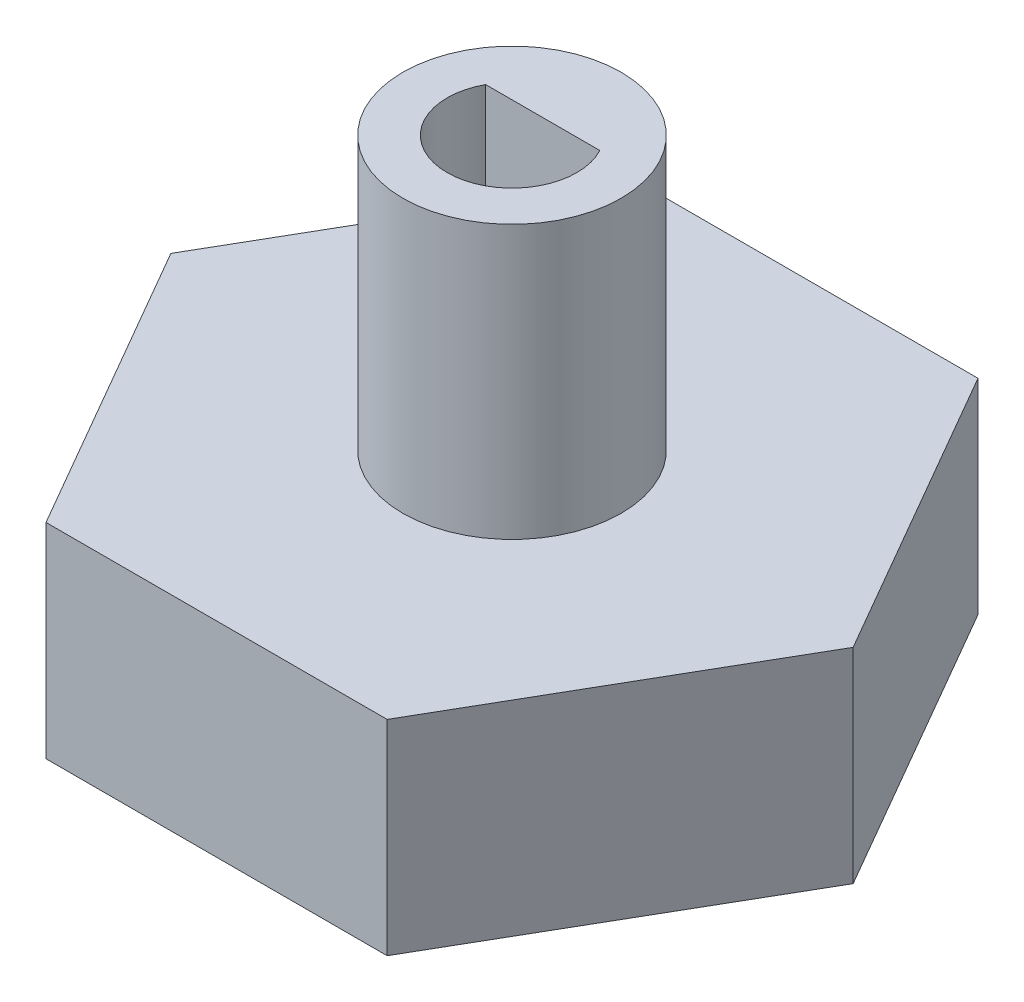
ISO-10303-21;
HEADER;
FILE_DESCRIPTION(('STEP AP214'),'2;1');
FILE_NAME('part.step','',(''),(''),'','','');
FILE_SCHEMA(('AUTOMOTIVE_DESIGN { 1 0 10303 214 1 1 1 1 }'));
ENDSEC;
DATA;
#1=APPLICATION_CONTEXT('core data for automotive mechanical design processes');
#2=APPLICATION_PROTOCOL_DEFINITION('international standard','automotive_design',2000,#1);
#3=PRODUCT_CONTEXT('',#1,'mechanical');
#4=PRODUCT('Part','Part','',(#3));
#5=PRODUCT_RELATED_PRODUCT_CATEGORY('part','',(#4));
#6=PRODUCT_DEFINITION_FORMATION('','',#4);
#7=PRODUCT_DEFINITION_CONTEXT('part definition',#1,'design');
#8=PRODUCT_DEFINITION('design','',#6,#7);
#9=PRODUCT_DEFINITION_SHAPE('','',#8);
#10=(LENGTH_UNIT() NAMED_UNIT(*) SI_UNIT(.MILLI.,.METRE.));
#11=(NAMED_UNIT(*) PLANE_ANGLE_UNIT() SI_UNIT($,.RADIAN.));
#12=(NAMED_UNIT(*) SI_UNIT($,.STERADIAN.) SOLID_ANGLE_UNIT());
#13=UNCERTAINTY_MEASURE_WITH_UNIT(LENGTH_MEASURE(1.E-05),#10,'distance_accuracy_value','');
#14=(GEOMETRIC_REPRESENTATION_CONTEXT(3) GLOBAL_UNCERTAINTY_ASSIGNED_CONTEXT((#13)) GLOBAL_UNIT_ASSIGNED_CONTEXT((#10,
#11,#12)) REPRESENTATION_CONTEXT('',''));
#15=CARTESIAN_POINT('',(0.,0.,0.));
#16=DIRECTION('',(0.,0.,1.));
#17=DIRECTION('',(1.,0.,0.));
#18=AXIS2_PLACEMENT_3D('',#15,#16,#17);
#19=CARTESIAN_POINT('',(3.17500000000006,3.81,5.49926131403115));
#20=DIRECTION('',(-0.866025403784441,0.,-0.499999999999995));
#21=DIRECTION('',(-0.499999999999995,0.,0.866025403784442));
#22=AXIS2_PLACEMENT_3D('',#19,#20,#21);
#23=PLANE('',#22);
#24=DIRECTION('',(0.499999999999995,0.,-0.866025403784441));
#25=VECTOR('',#24,1.);
#26=CARTESIAN_POINT('',(3.17500000000006,0.,5.49926131403115));
#27=LINE('',#26,#25);
#28=CARTESIAN_POINT('',(3.17500000000006,0.,5.49926131403115));
#29=VERTEX_POINT('',#28);
#30=CARTESIAN_POINT('',(6.35,0.,0.));
#31=VERTEX_POINT('',#30);
#32=EDGE_CURVE('E125',#29,#31,#27,.T.);
#33=ORIENTED_EDGE('',*,*,#32,.T.);
#34=DIRECTION('',(0.,-1.,0.));
#35=VECTOR('',#34,1.);
#36=CARTESIAN_POINT('',(6.35,3.81,0.));
#37=LINE('',#36,#35);
#38=CARTESIAN_POINT('',(6.35,3.81,0.));
#39=VERTEX_POINT('',#38);
#40=EDGE_CURVE('E44',#39,#31,#37,.T.);
#41=ORIENTED_EDGE('',*,*,#40,.F.);
#42=DIRECTION('',(0.499999999999995,0.,-0.866025403784441));
#43=VECTOR('',#42,1.);
#44=CARTESIAN_POINT('',(3.17500000000006,3.81,5.49926131403115));
#45=LINE('',#44,#43);
#46=CARTESIAN_POINT('',(3.17500000000006,3.81,5.49926131403115));
#47=VERTEX_POINT('',#46);
#48=EDGE_CURVE('E127',#47,#39,#45,.T.);
#49=ORIENTED_EDGE('',*,*,#48,.F.);
#50=DIRECTION('',(0.,-1.,0.));
#51=VECTOR('',#50,1.);
#52=CARTESIAN_POINT('',(3.17500000000006,3.81,5.49926131403115));
#53=LINE('',#52,#51);
#54=EDGE_CURVE('E141',#47,#29,#53,.T.);
#55=ORIENTED_EDGE('',*,*,#54,.T.);
#56=EDGE_LOOP('',(#33,#41,#49,#55));
#57=FACE_BOUND('',#56,.T.);
#58=ADVANCED_FACE('F41',(#57),#23,.F.);
#59=CARTESIAN_POINT('',(6.35,3.81,0.));
#60=DIRECTION('',(-0.866025403784438,0.,0.500000000000001));
#61=DIRECTION('',(0.500000000000001,0.,0.866025403784438));
#62=AXIS2_PLACEMENT_3D('',#59,#60,#61);
#63=PLANE('',#62);
#64=DIRECTION('',(-0.500000000000001,0.,-0.866025403784438));
#65=VECTOR('',#64,1.);
#66=CARTESIAN_POINT('',(6.35,0.,0.));
#67=LINE('',#66,#65);
#68=CARTESIAN_POINT('',(3.17499999999999,0.,-5.49926131403119));
#69=VERTEX_POINT('',#68);
#70=EDGE_CURVE('E144',#31,#69,#67,.T.);
#71=ORIENTED_EDGE('',*,*,#70,.T.);
#72=DIRECTION('',(0.,-1.,0.));
#73=VECTOR('',#72,1.);
#74=CARTESIAN_POINT('',(3.17499999999999,3.81,-5.49926131403119));
#75=LINE('',#74,#73);
#76=CARTESIAN_POINT('',(3.17499999999999,3.81,-5.49926131403119));
#77=VERTEX_POINT('',#76);
#78=EDGE_CURVE('E163',#77,#69,#75,.T.);
#79=ORIENTED_EDGE('',*,*,#78,.F.);
#80=DIRECTION('',(-0.500000000000001,0.,-0.866025403784438));
#81=VECTOR('',#80,1.);
#82=CARTESIAN_POINT('',(6.35,3.81,0.));
#83=LINE('',#82,#81);
#84=EDGE_CURVE('E130',#39,#77,#83,.T.);
#85=ORIENTED_EDGE('',*,*,#84,.F.);
#86=ORIENTED_EDGE('',*,*,#40,.T.);
#87=EDGE_LOOP('',(#71,#79,#85,#86));
#88=FACE_BOUND('',#87,.T.);
#89=ADVANCED_FACE('F172',(#88),#63,.F.);
#90=CARTESIAN_POINT('',(3.17499999999999,3.81,-5.49926131403119));
#91=DIRECTION('',(0.,0.,1.));
#92=DIRECTION('',(1.,0.,0.));
#93=AXIS2_PLACEMENT_3D('',#90,#91,#92);
#94=PLANE('',#93);
#95=DIRECTION('',(-1.,0.,0.));
#96=VECTOR('',#95,1.);
#97=CARTESIAN_POINT('',(3.17499999999999,0.,-5.49926131403119));
#98=LINE('',#97,#96);
#99=CARTESIAN_POINT('',(-3.17500000000002,0.,-5.49926131403117));
#100=VERTEX_POINT('',#99);
#101=EDGE_CURVE('E146',#69,#100,#98,.T.);
#102=ORIENTED_EDGE('',*,*,#101,.T.);
#103=DIRECTION('',(0.,-1.,0.));
#104=VECTOR('',#103,1.);
#105=CARTESIAN_POINT('',(-3.17500000000002,3.81,-5.49926131403117));
#106=LINE('',#105,#104);
#107=CARTESIAN_POINT('',(-3.17500000000002,3.81,-5.49926131403117));
#108=VERTEX_POINT('',#107);
#109=EDGE_CURVE('E161',#108,#100,#106,.T.);
#110=ORIENTED_EDGE('',*,*,#109,.F.);
#111=DIRECTION('',(-1.,0.,0.));
#112=VECTOR('',#111,1.);
#113=CARTESIAN_POINT('',(3.17499999999999,3.81,-5.49926131403119));
#114=LINE('',#113,#112);
#115=EDGE_CURVE('E133',#77,#108,#114,.T.);
#116=ORIENTED_EDGE('',*,*,#115,.F.);
#117=ORIENTED_EDGE('',*,*,#78,.T.);
#118=EDGE_LOOP('',(#102,#110,#116,#117));
#119=FACE_BOUND('',#118,.T.);
#120=ADVANCED_FACE('F183',(#119),#94,.F.);
#121=CARTESIAN_POINT('',(-3.17500000000002,3.81,-5.49926131403117));
#122=DIRECTION('',(0.866025403784441,0.,0.499999999999995));
#123=DIRECTION('',(0.499999999999995,0.,-0.866025403784442));
#124=AXIS2_PLACEMENT_3D('',#121,#122,#123);
#125=PLANE('',#124);
#126=DIRECTION('',(-0.499999999999995,0.,0.866025403784442));
#127=VECTOR('',#126,1.);
#128=CARTESIAN_POINT('',(-3.17500000000002,0.,-5.49926131403117));
#129=LINE('',#128,#127);
#130=CARTESIAN_POINT('',(-6.35,0.,0.));
#131=VERTEX_POINT('',#130);
#132=EDGE_CURVE('E148',#100,#131,#129,.T.);
#133=ORIENTED_EDGE('',*,*,#132,.T.);
#134=DIRECTION('',(0.,-1.,0.));
#135=VECTOR('',#134,1.);
#136=CARTESIAN_POINT('',(-6.35,3.81,0.));
#137=LINE('',#136,#135);
#138=CARTESIAN_POINT('',(-6.35,3.81,0.));
#139=VERTEX_POINT('',#138);
#140=EDGE_CURVE('E158',#139,#131,#137,.T.);
#141=ORIENTED_EDGE('',*,*,#140,.F.);
#142=DIRECTION('',(-0.499999999999995,0.,0.866025403784442));
#143=VECTOR('',#142,1.);
#144=CARTESIAN_POINT('',(-3.17500000000002,3.81,-5.49926131403117));
#145=LINE('',#144,#143);
#146=EDGE_CURVE('E135',#108,#139,#145,.T.);
#147=ORIENTED_EDGE('',*,*,#146,.F.);
#148=ORIENTED_EDGE('',*,*,#109,.T.);
#149=EDGE_LOOP('',(#133,#141,#147,#148));
#150=FACE_BOUND('',#149,.T.);
#151=ADVANCED_FACE('F186',(#150),#125,.F.);
#152=CARTESIAN_POINT('',(-6.35,3.81,0.));
#153=DIRECTION('',(0.866025403784435,0.,-0.500000000000007));
#154=DIRECTION('',(-0.500000000000007,0.,-0.866025403784435));
#155=AXIS2_PLACEMENT_3D('',#152,#153,#154);
#156=PLANE('',#155);
#157=DIRECTION('',(0.500000000000007,0.,0.866025403784434));
#158=VECTOR('',#157,1.);
#159=CARTESIAN_POINT('',(-6.35,0.,0.));
#160=LINE('',#159,#158);
#161=CARTESIAN_POINT('',(-3.17499999999995,0.,5.49926131403121));
#162=VERTEX_POINT('',#161);
#163=EDGE_CURVE('E150',#131,#162,#160,.T.);
#164=ORIENTED_EDGE('',*,*,#163,.T.);
#165=DIRECTION('',(0.,-1.,0.));
#166=VECTOR('',#165,1.);
#167=CARTESIAN_POINT('',(-3.17499999999995,3.81,5.49926131403121));
#168=LINE('',#167,#166);
#169=CARTESIAN_POINT('',(-3.17499999999995,3.81,5.49926131403121));
#170=VERTEX_POINT('',#169);
#171=EDGE_CURVE('E155',#170,#162,#168,.T.);
#172=ORIENTED_EDGE('',*,*,#171,.F.);
#173=DIRECTION('',(0.500000000000007,0.,0.866025403784434));
#174=VECTOR('',#173,1.);
#175=CARTESIAN_POINT('',(-6.35,3.81,0.));
#176=LINE('',#175,#174);
#177=EDGE_CURVE('E137',#139,#170,#176,.T.);
#178=ORIENTED_EDGE('',*,*,#177,.F.);
#179=ORIENTED_EDGE('',*,*,#140,.T.);
#180=EDGE_LOOP('',(#164,#172,#178,#179));
#181=FACE_BOUND('',#180,.T.);
#182=ADVANCED_FACE('F196',(#181),#156,.F.);
#183=CARTESIAN_POINT('',(-3.17499999999995,3.81,5.49926131403121));
#184=DIRECTION('',(0.,0.,-1.));
#185=DIRECTION('',(-1.,0.,0.));
#186=AXIS2_PLACEMENT_3D('',#183,#184,#185);
#187=PLANE('',#186);
#188=DIRECTION('',(1.,0.,0.));
#189=VECTOR('',#188,1.);
#190=CARTESIAN_POINT('',(-3.17499999999995,0.,5.49926131403121));
#191=LINE('',#190,#189);
#192=EDGE_CURVE('E131',#162,#29,#191,.T.);
#193=ORIENTED_EDGE('',*,*,#192,.T.);
#194=ORIENTED_EDGE('',*,*,#54,.F.);
#195=DIRECTION('',(1.,0.,0.));
#196=VECTOR('',#195,1.);
#197=CARTESIAN_POINT('',(-3.17499999999995,3.81,5.49926131403121));
#198=LINE('',#197,#196);
#199=EDGE_CURVE('E139',#170,#47,#198,.T.);
#200=ORIENTED_EDGE('',*,*,#199,.F.);
#201=ORIENTED_EDGE('',*,*,#171,.T.);
#202=EDGE_LOOP('',(#193,#194,#200,#201));
#203=FACE_BOUND('',#202,.T.);
#204=ADVANCED_FACE('F194',(#203),#187,.F.);
#205=CARTESIAN_POINT('',(0.,3.81,0.));
#206=DIRECTION('',(0.,1.,0.));
#207=DIRECTION('',(0.,0.,1.));
#208=AXIS2_PLACEMENT_3D('',#205,#206,#207);
#209=PLANE('',#208);
#210=CARTESIAN_POINT('',(0.,3.81,0.));
#211=DIRECTION('',(0.,1.,0.));
#212=DIRECTION('',(0.,0.,1.));
#213=AXIS2_PLACEMENT_3D('',#210,#211,#212);
#214=CIRCLE('',#213,2.032);
#215=CARTESIAN_POINT('',(0.,3.81,2.032));
#216=VERTEX_POINT('',#215);
#217=EDGE_CURVE('E11',#216,#216,#214,.T.);
#218=ORIENTED_EDGE('',*,*,#217,.F.);
#219=EDGE_LOOP('',(#218));
#220=FACE_BOUND('',#219,.T.);
#221=ORIENTED_EDGE('',*,*,#48,.T.);
#222=ORIENTED_EDGE('',*,*,#84,.T.);
#223=ORIENTED_EDGE('',*,*,#115,.T.);
#224=ORIENTED_EDGE('',*,*,#146,.T.);
#225=ORIENTED_EDGE('',*,*,#177,.T.);
#226=ORIENTED_EDGE('',*,*,#199,.T.);
#227=EDGE_LOOP('',(#221,#222,#223,#224,#225,#226));
#228=FACE_BOUND('',#227,.T.);
#229=ADVANCED_FACE('F190',(#220,#228),#209,.T.);
#230=CARTESIAN_POINT('',(0.,0.,0.));
#231=DIRECTION('',(0.,1.,0.));
#232=DIRECTION('',(0.,0.,1.));
#233=AXIS2_PLACEMENT_3D('',#230,#231,#232);
#234=PLANE('',#233);
#235=DIRECTION('',(1.,0.,0.));
#236=VECTOR('',#235,1.);
#237=CARTESIAN_POINT('',(-1.06255823369828,0.,-0.5715));
#238=LINE('',#237,#236);
#239=CARTESIAN_POINT('',(-1.06255823369828,0.,-0.5715));
#240=VERTEX_POINT('',#239);
#241=CARTESIAN_POINT('',(1.06255823369828,0.,-0.5715));
#242=VERTEX_POINT('',#241);
#243=EDGE_CURVE('E117',#240,#242,#238,.T.);
#244=ORIENTED_EDGE('',*,*,#243,.F.);
#245=CARTESIAN_POINT('',(0.,0.,0.));
#246=DIRECTION('',(0.,-1.,0.));
#247=DIRECTION('',(0.,0.,-1.));
#248=AXIS2_PLACEMENT_3D('',#245,#246,#247);
#249=CIRCLE('',#248,1.2065);
#250=EDGE_CURVE('E56',#242,#240,#249,.T.);
#251=ORIENTED_EDGE('',*,*,#250,.F.);
#252=EDGE_LOOP('',(#244,#251));
#253=FACE_BOUND('',#252,.T.);
#254=ORIENTED_EDGE('',*,*,#32,.F.);
#255=ORIENTED_EDGE('',*,*,#192,.F.);
#256=ORIENTED_EDGE('',*,*,#163,.F.);
#257=ORIENTED_EDGE('',*,*,#132,.F.);
#258=ORIENTED_EDGE('',*,*,#101,.F.);
#259=ORIENTED_EDGE('',*,*,#70,.F.);
#260=EDGE_LOOP('',(#254,#255,#256,#257,#258,#259));
#261=FACE_BOUND('',#260,.T.);
#262=ADVANCED_FACE('F179',(#253,#261),#234,.F.);
#263=CARTESIAN_POINT('',(0.,8.89,0.));
#264=DIRECTION('',(0.,-1.,0.));
#265=DIRECTION('',(0.,0.,-1.));
#266=AXIS2_PLACEMENT_3D('',#263,#264,#265);
#267=CYLINDRICAL_SURFACE('',#266,2.032);
#268=CARTESIAN_POINT('',(0.,8.89,0.));
#269=DIRECTION('',(0.,1.,0.));
#270=DIRECTION('',(0.,0.,1.));
#271=AXIS2_PLACEMENT_3D('',#268,#269,#270);
#272=CIRCLE('',#271,2.032);
#273=CARTESIAN_POINT('',(0.,8.89,2.032));
#274=VERTEX_POINT('',#273);
#275=EDGE_CURVE('E122',#274,#274,#272,.T.);
#276=ORIENTED_EDGE('',*,*,#275,.F.);
#277=EDGE_LOOP('',(#276));
#278=FACE_BOUND('',#277,.T.);
#279=ORIENTED_EDGE('',*,*,#217,.T.);
#280=EDGE_LOOP('',(#279));
#281=FACE_BOUND('',#280,.T.);
#282=ADVANCED_FACE('F250',(#278,#281),#267,.T.);
#283=CARTESIAN_POINT('',(0.,8.89,0.));
#284=DIRECTION('',(0.,1.,0.));
#285=DIRECTION('',(0.,0.,1.));
#286=AXIS2_PLACEMENT_3D('',#283,#284,#285);
#287=PLANE('',#286);
#288=CARTESIAN_POINT('',(0.,8.89,0.));
#289=DIRECTION('',(0.,-1.,0.));
#290=DIRECTION('',(0.,0.,-1.));
#291=AXIS2_PLACEMENT_3D('',#288,#289,#290);
#292=CIRCLE('',#291,1.2065);
#293=CARTESIAN_POINT('',(1.06255823369828,8.89,-0.5715));
#294=VERTEX_POINT('',#293);
#295=CARTESIAN_POINT('',(-1.06255823369828,8.89,-0.5715));
#296=VERTEX_POINT('',#295);
#297=EDGE_CURVE('E61',#294,#296,#292,.T.);
#298=ORIENTED_EDGE('',*,*,#297,.T.);
#299=DIRECTION('',(1.,0.,0.));
#300=VECTOR('',#299,1.);
#301=CARTESIAN_POINT('',(-1.06255823369828,8.89,-0.5715));
#302=LINE('',#301,#300);
#303=EDGE_CURVE('E109',#296,#294,#302,.T.);
#304=ORIENTED_EDGE('',*,*,#303,.T.);
#305=EDGE_LOOP('',(#298,#304));
#306=FACE_BOUND('',#305,.T.);
#307=ORIENTED_EDGE('',*,*,#275,.T.);
#308=EDGE_LOOP('',(#307));
#309=FACE_BOUND('',#308,.T.);
#310=ADVANCED_FACE('F115',(#306,#309),#287,.T.);
#311=CARTESIAN_POINT('',(0.,8.89,0.));
#312=DIRECTION('',(0.,-1.,0.));
#313=DIRECTION('',(0.,0.,-1.));
#314=AXIS2_PLACEMENT_3D('',#311,#312,#313);
#315=CYLINDRICAL_SURFACE('',#314,1.2065);
#316=ORIENTED_EDGE('',*,*,#250,.T.);
#317=DIRECTION('',(0.,-1.,0.));
#318=VECTOR('',#317,1.);
#319=CARTESIAN_POINT('',(-1.06255823369828,8.89,-0.5715));
#320=LINE('',#319,#318);
#321=EDGE_CURVE('E102',#296,#240,#320,.T.);
#322=ORIENTED_EDGE('',*,*,#321,.F.);
#323=ORIENTED_EDGE('',*,*,#297,.F.);
#324=DIRECTION('',(0.,-1.,0.));
#325=VECTOR('',#324,1.);
#326=CARTESIAN_POINT('',(1.06255823369828,8.89,-0.5715));
#327=LINE('',#326,#325);
#328=EDGE_CURVE('E108',#294,#242,#327,.T.);
#329=ORIENTED_EDGE('',*,*,#328,.T.);
#330=EDGE_LOOP('',(#316,#322,#323,#329));
#331=FACE_BOUND('',#330,.T.);
#332=ADVANCED_FACE('F104',(#331),#315,.F.);
#333=CARTESIAN_POINT('',(-1.06255823369828,8.89,-0.5715));
#334=DIRECTION('',(0.,0.,-1.));
#335=DIRECTION('',(-1.,0.,0.));
#336=AXIS2_PLACEMENT_3D('',#333,#334,#335);
#337=PLANE('',#336);
#338=ORIENTED_EDGE('',*,*,#243,.T.);
#339=ORIENTED_EDGE('',*,*,#328,.F.);
#340=ORIENTED_EDGE('',*,*,#303,.F.);
#341=ORIENTED_EDGE('',*,*,#321,.T.);
#342=EDGE_LOOP('',(#338,#339,#340,#341));
#343=FACE_BOUND('',#342,.T.);
#344=ADVANCED_FACE('F112',(#343),#337,.F.);
#345=CLOSED_SHELL('',(#58,#89,#120,#151,#182,#204,#229,#262,#282,#310,#332,#344));
#346=MANIFOLD_SOLID_BREP('B2',#345);
#347=ADVANCED_BREP_SHAPE_REPRESENTATION('',(#18,#346),#14);
#348=SHAPE_DEFINITION_REPRESENTATION(#9,#347);
ENDSEC;
END-ISO-10303-21;
